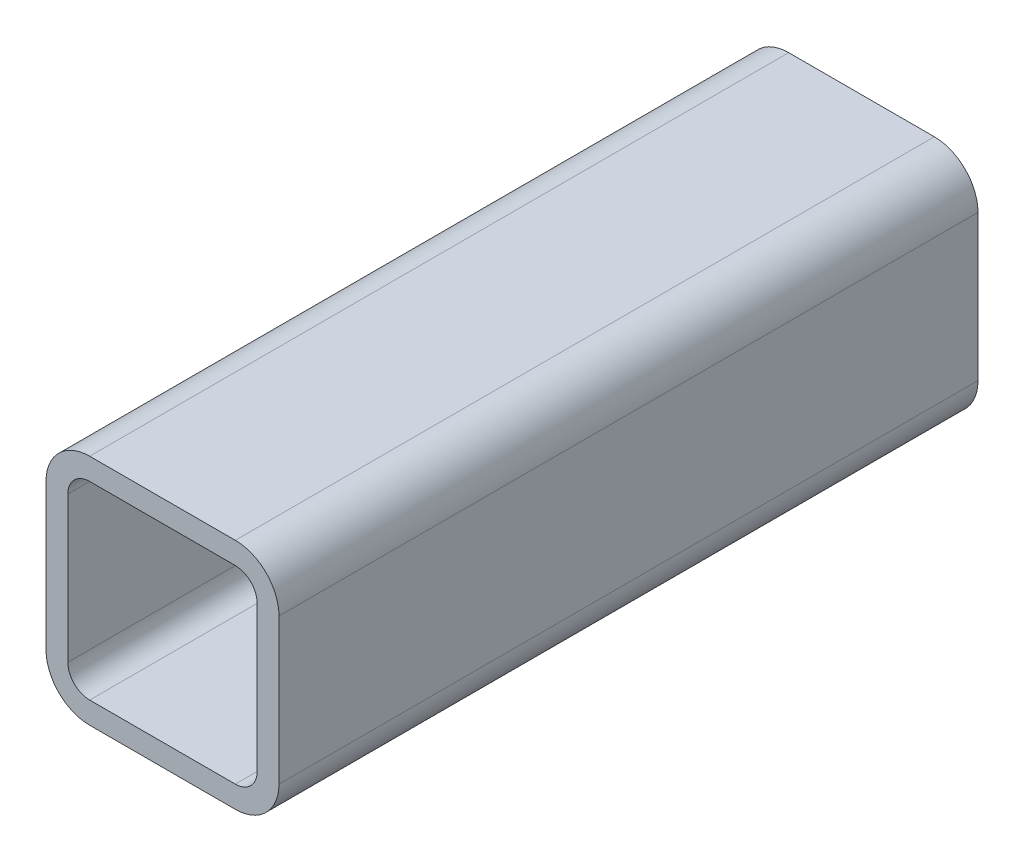
ISO-10303-21;
HEADER;
FILE_DESCRIPTION(('STEP AP214'),'2;1');
FILE_NAME('part.step','',(''),(''),'','','');
FILE_SCHEMA(('AUTOMOTIVE_DESIGN { 1 0 10303 214 1 1 1 1 }'));
ENDSEC;
DATA;
#1=APPLICATION_CONTEXT('core data for automotive mechanical design processes');
#2=APPLICATION_PROTOCOL_DEFINITION('international standard','automotive_design',2000,#1);
#3=PRODUCT_CONTEXT('',#1,'mechanical');
#4=PRODUCT('Part','Part','',(#3));
#5=PRODUCT_RELATED_PRODUCT_CATEGORY('part','',(#4));
#6=PRODUCT_DEFINITION_FORMATION('','',#4);
#7=PRODUCT_DEFINITION_CONTEXT('part definition',#1,'design');
#8=PRODUCT_DEFINITION('design','',#6,#7);
#9=PRODUCT_DEFINITION_SHAPE('','',#8);
#10=(LENGTH_UNIT() NAMED_UNIT(*) SI_UNIT(.MILLI.,.METRE.));
#11=(NAMED_UNIT(*) PLANE_ANGLE_UNIT() SI_UNIT($,.RADIAN.));
#12=(NAMED_UNIT(*) SI_UNIT($,.STERADIAN.) SOLID_ANGLE_UNIT());
#13=UNCERTAINTY_MEASURE_WITH_UNIT(LENGTH_MEASURE(1.E-05),#10,'distance_accuracy_value','');
#14=(GEOMETRIC_REPRESENTATION_CONTEXT(3) GLOBAL_UNCERTAINTY_ASSIGNED_CONTEXT((#13)) GLOBAL_UNIT_ASSIGNED_CONTEXT((#10,
#11,#12)) REPRESENTATION_CONTEXT('',''));
#15=CARTESIAN_POINT('',(0.,0.,0.));
#16=DIRECTION('',(0.,0.,1.));
#17=DIRECTION('',(1.,0.,0.));
#18=AXIS2_PLACEMENT_3D('',#15,#16,#17);
#19=CARTESIAN_POINT('',(41.27496425,41.27496425,76.2));
#20=DIRECTION('',(0.,0.,1.));
#21=DIRECTION('',(1.,0.,0.));
#22=AXIS2_PLACEMENT_3D('',#19,#20,#21);
#23=PLANE('',#22);
#24=CARTESIAN_POINT('',(41.27496425,41.27496425,76.2));
#25=DIRECTION('',(0.,0.,1.));
#26=DIRECTION('',(1.,0.,0.));
#27=AXIS2_PLACEMENT_3D('',#24,#25,#26);
#28=CIRCLE('',#27,9.52499175);
#29=CARTESIAN_POINT('',(50.799956,41.27496425,76.2));
#30=VERTEX_POINT('',#29);
#31=CARTESIAN_POINT('',(41.27496425,50.799956,76.2));
#32=VERTEX_POINT('',#31);
#33=EDGE_CURVE('E213',#30,#32,#28,.T.);
#34=ORIENTED_EDGE('',*,*,#33,.T.);
#35=DIRECTION('',(-1.,0.,0.));
#36=VECTOR('',#35,1.);
#37=CARTESIAN_POINT('',(41.27496425,50.799956,76.2));
#38=LINE('',#37,#36);
#39=CARTESIAN_POINT('',(9.52499174999999,50.799956,76.2));
#40=VERTEX_POINT('',#39);
#41=EDGE_CURVE('E216',#32,#40,#38,.T.);
#42=ORIENTED_EDGE('',*,*,#41,.T.);
#43=CARTESIAN_POINT('',(9.52499174999999,41.27496425,76.2));
#44=DIRECTION('',(0.,0.,1.));
#45=DIRECTION('',(1.,0.,0.));
#46=AXIS2_PLACEMENT_3D('',#43,#44,#45);
#47=CIRCLE('',#46,9.52499175);
#48=CARTESIAN_POINT('',(0.,41.27496425,76.2));
#49=VERTEX_POINT('',#48);
#50=EDGE_CURVE('E219',#40,#49,#47,.T.);
#51=ORIENTED_EDGE('',*,*,#50,.T.);
#52=DIRECTION('',(0.,-1.,0.));
#53=VECTOR('',#52,1.);
#54=CARTESIAN_POINT('',(0.,9.52499175,76.2));
#55=LINE('',#54,#53);
#56=CARTESIAN_POINT('',(0.,9.52499175,76.2));
#57=VERTEX_POINT('',#56);
#58=EDGE_CURVE('E221',#49,#57,#55,.T.);
#59=ORIENTED_EDGE('',*,*,#58,.T.);
#60=CARTESIAN_POINT('',(9.52499175,9.52499175,76.2));
#61=DIRECTION('',(0.,0.,1.));
#62=DIRECTION('',(1.,0.,0.));
#63=AXIS2_PLACEMENT_3D('',#60,#61,#62);
#64=CIRCLE('',#63,9.52499175);
#65=CARTESIAN_POINT('',(9.52499175,0.,76.2));
#66=VERTEX_POINT('',#65);
#67=EDGE_CURVE('E223',#57,#66,#64,.T.);
#68=ORIENTED_EDGE('',*,*,#67,.T.);
#69=DIRECTION('',(1.,0.,0.));
#70=VECTOR('',#69,1.);
#71=CARTESIAN_POINT('',(9.52499175,0.,76.2));
#72=LINE('',#71,#70);
#73=CARTESIAN_POINT('',(41.27496425,0.,76.2));
#74=VERTEX_POINT('',#73);
#75=EDGE_CURVE('E225',#66,#74,#72,.T.);
#76=ORIENTED_EDGE('',*,*,#75,.T.);
#77=CARTESIAN_POINT('',(41.27496425,9.52499175,76.2));
#78=DIRECTION('',(0.,0.,1.));
#79=DIRECTION('',(1.,0.,0.));
#80=AXIS2_PLACEMENT_3D('',#77,#78,#79);
#81=CIRCLE('',#80,9.52499175);
#82=CARTESIAN_POINT('',(50.799956,9.52499175,76.2));
#83=VERTEX_POINT('',#82);
#84=EDGE_CURVE('E227',#74,#83,#81,.T.);
#85=ORIENTED_EDGE('',*,*,#84,.T.);
#86=DIRECTION('',(0.,1.,0.));
#87=VECTOR('',#86,1.);
#88=CARTESIAN_POINT('',(50.799956,41.27496425,76.2));
#89=LINE('',#88,#87);
#90=EDGE_CURVE('E229',#83,#30,#89,.T.);
#91=ORIENTED_EDGE('',*,*,#90,.T.);
#92=EDGE_LOOP('',(#34,#42,#51,#59,#68,#76,#85,#91));
#93=FACE_BOUND('',#92,.T.);
#94=DIRECTION('',(0.,-1.,0.));
#95=VECTOR('',#94,1.);
#96=CARTESIAN_POINT('',(4.762495875,9.52499175,76.2));
#97=LINE('',#96,#95);
#98=CARTESIAN_POINT('',(4.76249587499999,41.27496425,76.2));
#99=VERTEX_POINT('',#98);
#100=CARTESIAN_POINT('',(4.762495875,9.52499175,76.2));
#101=VERTEX_POINT('',#100);
#102=EDGE_CURVE('E156',#99,#101,#97,.T.);
#103=ORIENTED_EDGE('',*,*,#102,.F.);
#104=CARTESIAN_POINT('',(9.52499174999999,41.27496425,76.2));
#105=DIRECTION('',(0.,0.,1.));
#106=DIRECTION('',(1.,0.,0.));
#107=AXIS2_PLACEMENT_3D('',#104,#105,#106);
#108=CIRCLE('',#107,4.762495875);
#109=CARTESIAN_POINT('',(9.52499174999999,46.037460125,76.2));
#110=VERTEX_POINT('',#109);
#111=EDGE_CURVE('E148',#110,#99,#108,.T.);
#112=ORIENTED_EDGE('',*,*,#111,.F.);
#113=DIRECTION('',(-1.,0.,0.));
#114=VECTOR('',#113,1.);
#115=CARTESIAN_POINT('',(41.27496425,46.037460125,76.2));
#116=LINE('',#115,#114);
#117=CARTESIAN_POINT('',(41.27496425,46.037460125,76.2));
#118=VERTEX_POINT('',#117);
#119=EDGE_CURVE('E181',#118,#110,#116,.T.);
#120=ORIENTED_EDGE('',*,*,#119,.F.);
#121=CARTESIAN_POINT('',(41.27496425,41.27496425,76.2));
#122=DIRECTION('',(0.,0.,1.));
#123=DIRECTION('',(1.,0.,0.));
#124=AXIS2_PLACEMENT_3D('',#121,#122,#123);
#125=CIRCLE('',#124,4.76249587500001);
#126=CARTESIAN_POINT('',(46.037460125,41.27496425,76.2));
#127=VERTEX_POINT('',#126);
#128=EDGE_CURVE('E179',#127,#118,#125,.T.);
#129=ORIENTED_EDGE('',*,*,#128,.F.);
#130=DIRECTION('',(0.,1.,0.));
#131=VECTOR('',#130,1.);
#132=CARTESIAN_POINT('',(46.037460125,41.27496425,76.2));
#133=LINE('',#132,#131);
#134=CARTESIAN_POINT('',(46.037460125,9.52499175,76.2));
#135=VERTEX_POINT('',#134);
#136=EDGE_CURVE('E177',#135,#127,#133,.T.);
#137=ORIENTED_EDGE('',*,*,#136,.F.);
#138=CARTESIAN_POINT('',(41.27496425,9.52499175,76.2));
#139=DIRECTION('',(0.,0.,1.));
#140=DIRECTION('',(1.,0.,0.));
#141=AXIS2_PLACEMENT_3D('',#138,#139,#140);
#142=CIRCLE('',#141,4.762495875);
#143=CARTESIAN_POINT('',(41.27496425,4.762495875,76.2));
#144=VERTEX_POINT('',#143);
#145=EDGE_CURVE('E175',#144,#135,#142,.T.);
#146=ORIENTED_EDGE('',*,*,#145,.F.);
#147=DIRECTION('',(1.,0.,0.));
#148=VECTOR('',#147,1.);
#149=CARTESIAN_POINT('',(9.52499175,4.762495875,76.2));
#150=LINE('',#149,#148);
#151=CARTESIAN_POINT('',(9.52499175,4.762495875,76.2));
#152=VERTEX_POINT('',#151);
#153=EDGE_CURVE('E171',#152,#144,#150,.T.);
#154=ORIENTED_EDGE('',*,*,#153,.F.);
#155=CARTESIAN_POINT('',(9.52499175,9.52499175,76.2));
#156=DIRECTION('',(0.,0.,1.));
#157=DIRECTION('',(1.,0.,0.));
#158=AXIS2_PLACEMENT_3D('',#155,#156,#157);
#159=CIRCLE('',#158,4.762495875);
#160=EDGE_CURVE('E169',#101,#152,#159,.T.);
#161=ORIENTED_EDGE('',*,*,#160,.F.);
#162=EDGE_LOOP('',(#103,#112,#120,#129,#137,#146,#154,#161));
#163=FACE_BOUND('',#162,.T.);
#164=ADVANCED_FACE('F35',(#93,#163),#23,.T.);
#165=CARTESIAN_POINT('',(41.27496425,41.27496425,-76.2));
#166=DIRECTION('',(0.,0.,1.));
#167=DIRECTION('',(1.,0.,0.));
#168=AXIS2_PLACEMENT_3D('',#165,#166,#167);
#169=PLANE('',#168);
#170=CARTESIAN_POINT('',(41.27496425,41.27496425,-76.2));
#171=DIRECTION('',(0.,0.,1.));
#172=DIRECTION('',(1.,0.,0.));
#173=AXIS2_PLACEMENT_3D('',#170,#171,#172);
#174=CIRCLE('',#173,9.52499175);
#175=CARTESIAN_POINT('',(50.799956,41.27496425,-76.2));
#176=VERTEX_POINT('',#175);
#177=CARTESIAN_POINT('',(41.27496425,50.799956,-76.2));
#178=VERTEX_POINT('',#177);
#179=EDGE_CURVE('E164',#176,#178,#174,.T.);
#180=ORIENTED_EDGE('',*,*,#179,.F.);
#181=DIRECTION('',(0.,1.,0.));
#182=VECTOR('',#181,1.);
#183=CARTESIAN_POINT('',(50.799956,41.27496425,-76.2));
#184=LINE('',#183,#182);
#185=CARTESIAN_POINT('',(50.799956,9.52499175,-76.2));
#186=VERTEX_POINT('',#185);
#187=EDGE_CURVE('E217',#186,#176,#184,.T.);
#188=ORIENTED_EDGE('',*,*,#187,.F.);
#189=CARTESIAN_POINT('',(41.27496425,9.52499175,-76.2));
#190=DIRECTION('',(0.,0.,1.));
#191=DIRECTION('',(1.,0.,0.));
#192=AXIS2_PLACEMENT_3D('',#189,#190,#191);
#193=CIRCLE('',#192,9.52499175);
#194=CARTESIAN_POINT('',(41.27496425,0.,-76.2));
#195=VERTEX_POINT('',#194);
#196=EDGE_CURVE('E244',#195,#186,#193,.T.);
#197=ORIENTED_EDGE('',*,*,#196,.F.);
#198=DIRECTION('',(1.,0.,0.));
#199=VECTOR('',#198,1.);
#200=CARTESIAN_POINT('',(9.52499175,0.,-76.2));
#201=LINE('',#200,#199);
#202=CARTESIAN_POINT('',(9.52499175,0.,-76.2));
#203=VERTEX_POINT('',#202);
#204=EDGE_CURVE('E242',#203,#195,#201,.T.);
#205=ORIENTED_EDGE('',*,*,#204,.F.);
#206=CARTESIAN_POINT('',(9.52499175,9.52499175,-76.2));
#207=DIRECTION('',(0.,0.,1.));
#208=DIRECTION('',(1.,0.,0.));
#209=AXIS2_PLACEMENT_3D('',#206,#207,#208);
#210=CIRCLE('',#209,9.52499175);
#211=CARTESIAN_POINT('',(0.,9.52499175,-76.2));
#212=VERTEX_POINT('',#211);
#213=EDGE_CURVE('E240',#212,#203,#210,.T.);
#214=ORIENTED_EDGE('',*,*,#213,.F.);
#215=DIRECTION('',(0.,-1.,0.));
#216=VECTOR('',#215,1.);
#217=CARTESIAN_POINT('',(0.,9.52499175,-76.2));
#218=LINE('',#217,#216);
#219=CARTESIAN_POINT('',(0.,41.27496425,-76.2));
#220=VERTEX_POINT('',#219);
#221=EDGE_CURVE('E238',#220,#212,#218,.T.);
#222=ORIENTED_EDGE('',*,*,#221,.F.);
#223=CARTESIAN_POINT('',(9.52499174999999,41.27496425,-76.2));
#224=DIRECTION('',(0.,0.,1.));
#225=DIRECTION('',(1.,0.,0.));
#226=AXIS2_PLACEMENT_3D('',#223,#224,#225);
#227=CIRCLE('',#226,9.52499175);
#228=CARTESIAN_POINT('',(9.52499174999999,50.799956,-76.2));
#229=VERTEX_POINT('',#228);
#230=EDGE_CURVE('E236',#229,#220,#227,.T.);
#231=ORIENTED_EDGE('',*,*,#230,.F.);
#232=DIRECTION('',(-1.,0.,0.));
#233=VECTOR('',#232,1.);
#234=CARTESIAN_POINT('',(41.27496425,50.799956,-76.2));
#235=LINE('',#234,#233);
#236=EDGE_CURVE('E234',#178,#229,#235,.T.);
#237=ORIENTED_EDGE('',*,*,#236,.F.);
#238=EDGE_LOOP('',(#180,#188,#197,#205,#214,#222,#231,#237));
#239=FACE_BOUND('',#238,.T.);
#240=CARTESIAN_POINT('',(9.52499174999999,41.27496425,-76.2));
#241=DIRECTION('',(0.,0.,1.));
#242=DIRECTION('',(1.,0.,0.));
#243=AXIS2_PLACEMENT_3D('',#240,#241,#242);
#244=CIRCLE('',#243,4.762495875);
#245=CARTESIAN_POINT('',(9.52499175,46.037460125,-76.2));
#246=VERTEX_POINT('',#245);
#247=CARTESIAN_POINT('',(4.76249587499999,41.27496425,-76.2));
#248=VERTEX_POINT('',#247);
#249=EDGE_CURVE('E58',#246,#248,#244,.T.);
#250=ORIENTED_EDGE('',*,*,#249,.T.);
#251=DIRECTION('',(0.,-1.,0.));
#252=VECTOR('',#251,1.);
#253=CARTESIAN_POINT('',(4.762495875,9.52499175,-76.2));
#254=LINE('',#253,#252);
#255=CARTESIAN_POINT('',(4.762495875,9.52499175,-76.2));
#256=VERTEX_POINT('',#255);
#257=EDGE_CURVE('E163',#248,#256,#254,.T.);
#258=ORIENTED_EDGE('',*,*,#257,.T.);
#259=CARTESIAN_POINT('',(9.52499175,9.52499175,-76.2));
#260=DIRECTION('',(0.,0.,1.));
#261=DIRECTION('',(1.,0.,0.));
#262=AXIS2_PLACEMENT_3D('',#259,#260,#261);
#263=CIRCLE('',#262,4.762495875);
#264=CARTESIAN_POINT('',(9.52499175,4.762495875,-76.2));
#265=VERTEX_POINT('',#264);
#266=EDGE_CURVE('E185',#256,#265,#263,.T.);
#267=ORIENTED_EDGE('',*,*,#266,.T.);
#268=DIRECTION('',(1.,0.,0.));
#269=VECTOR('',#268,1.);
#270=CARTESIAN_POINT('',(9.52499175,4.762495875,-76.2));
#271=LINE('',#270,#269);
#272=CARTESIAN_POINT('',(41.27496425,4.762495875,-76.2));
#273=VERTEX_POINT('',#272);
#274=EDGE_CURVE('E188',#265,#273,#271,.T.);
#275=ORIENTED_EDGE('',*,*,#274,.T.);
#276=CARTESIAN_POINT('',(41.27496425,9.52499175,-76.2));
#277=DIRECTION('',(0.,0.,1.));
#278=DIRECTION('',(1.,0.,0.));
#279=AXIS2_PLACEMENT_3D('',#276,#277,#278);
#280=CIRCLE('',#279,4.762495875);
#281=CARTESIAN_POINT('',(46.037460125,9.52499175,-76.2));
#282=VERTEX_POINT('',#281);
#283=EDGE_CURVE('E191',#273,#282,#280,.T.);
#284=ORIENTED_EDGE('',*,*,#283,.T.);
#285=DIRECTION('',(0.,1.,0.));
#286=VECTOR('',#285,1.);
#287=CARTESIAN_POINT('',(46.037460125,41.27496425,-76.2));
#288=LINE('',#287,#286);
#289=CARTESIAN_POINT('',(46.037460125,41.27496425,-76.2));
#290=VERTEX_POINT('',#289);
#291=EDGE_CURVE('E194',#282,#290,#288,.T.);
#292=ORIENTED_EDGE('',*,*,#291,.T.);
#293=CARTESIAN_POINT('',(41.27496425,41.27496425,-76.2));
#294=DIRECTION('',(0.,0.,1.));
#295=DIRECTION('',(1.,0.,0.));
#296=AXIS2_PLACEMENT_3D('',#293,#294,#295);
#297=CIRCLE('',#296,4.76249587500001);
#298=CARTESIAN_POINT('',(41.27496425,46.037460125,-76.2));
#299=VERTEX_POINT('',#298);
#300=EDGE_CURVE('E197',#290,#299,#297,.T.);
#301=ORIENTED_EDGE('',*,*,#300,.T.);
#302=DIRECTION('',(-1.,0.,0.));
#303=VECTOR('',#302,1.);
#304=CARTESIAN_POINT('',(41.27496425,46.037460125,-76.2));
#305=LINE('',#304,#303);
#306=EDGE_CURVE('E157',#299,#246,#305,.T.);
#307=ORIENTED_EDGE('',*,*,#306,.T.);
#308=EDGE_LOOP('',(#250,#258,#267,#275,#284,#292,#301,#307));
#309=FACE_BOUND('',#308,.T.);
#310=ADVANCED_FACE('F274',(#239,#309),#169,.F.);
#311=CARTESIAN_POINT('',(41.27496425,41.27496425,76.2));
#312=DIRECTION('',(0.,0.,-1.));
#313=DIRECTION('',(-1.,0.,0.));
#314=AXIS2_PLACEMENT_3D('',#311,#312,#313);
#315=CYLINDRICAL_SURFACE('',#314,9.52499175);
#316=ORIENTED_EDGE('',*,*,#179,.T.);
#317=DIRECTION('',(0.,0.,-1.));
#318=VECTOR('',#317,1.);
#319=CARTESIAN_POINT('',(41.27496425,50.799956,76.2));
#320=LINE('',#319,#318);
#321=EDGE_CURVE('E11',#32,#178,#320,.T.);
#322=ORIENTED_EDGE('',*,*,#321,.F.);
#323=ORIENTED_EDGE('',*,*,#33,.F.);
#324=DIRECTION('',(0.,0.,-1.));
#325=VECTOR('',#324,1.);
#326=CARTESIAN_POINT('',(50.799956,41.27496425,76.2));
#327=LINE('',#326,#325);
#328=EDGE_CURVE('E231',#30,#176,#327,.T.);
#329=ORIENTED_EDGE('',*,*,#328,.T.);
#330=EDGE_LOOP('',(#316,#322,#323,#329));
#331=FACE_BOUND('',#330,.T.);
#332=ADVANCED_FACE('F37',(#331),#315,.T.);
#333=CARTESIAN_POINT('',(41.27496425,50.799956,76.2));
#334=DIRECTION('',(0.,-1.,0.));
#335=DIRECTION('',(0.,0.,-1.));
#336=AXIS2_PLACEMENT_3D('',#333,#334,#335);
#337=PLANE('',#336);
#338=ORIENTED_EDGE('',*,*,#236,.T.);
#339=DIRECTION('',(0.,0.,-1.));
#340=VECTOR('',#339,1.);
#341=CARTESIAN_POINT('',(9.52499174999999,50.799956,76.2));
#342=LINE('',#341,#340);
#343=EDGE_CURVE('E43',#40,#229,#342,.T.);
#344=ORIENTED_EDGE('',*,*,#343,.F.);
#345=ORIENTED_EDGE('',*,*,#41,.F.);
#346=ORIENTED_EDGE('',*,*,#321,.T.);
#347=EDGE_LOOP('',(#338,#344,#345,#346));
#348=FACE_BOUND('',#347,.T.);
#349=ADVANCED_FACE('F291',(#348),#337,.F.);
#350=CARTESIAN_POINT('',(9.52499174999999,41.27496425,76.2));
#351=DIRECTION('',(0.,0.,-1.));
#352=DIRECTION('',(-1.,0.,0.));
#353=AXIS2_PLACEMENT_3D('',#350,#351,#352);
#354=CYLINDRICAL_SURFACE('',#353,9.52499175);
#355=ORIENTED_EDGE('',*,*,#230,.T.);
#356=DIRECTION('',(0.,0.,-1.));
#357=VECTOR('',#356,1.);
#358=CARTESIAN_POINT('',(0.,41.27496425,76.2));
#359=LINE('',#358,#357);
#360=EDGE_CURVE('E261',#49,#220,#359,.T.);
#361=ORIENTED_EDGE('',*,*,#360,.F.);
#362=ORIENTED_EDGE('',*,*,#50,.F.);
#363=ORIENTED_EDGE('',*,*,#343,.T.);
#364=EDGE_LOOP('',(#355,#361,#362,#363));
#365=FACE_BOUND('',#364,.T.);
#366=ADVANCED_FACE('F268',(#365),#354,.T.);
#367=CARTESIAN_POINT('',(0.,9.52499175,76.2));
#368=DIRECTION('',(1.,0.,0.));
#369=DIRECTION('',(0.,1.,0.));
#370=AXIS2_PLACEMENT_3D('',#367,#368,#369);
#371=PLANE('',#370);
#372=ORIENTED_EDGE('',*,*,#221,.T.);
#373=DIRECTION('',(0.,0.,-1.));
#374=VECTOR('',#373,1.);
#375=CARTESIAN_POINT('',(0.,9.52499175,76.2));
#376=LINE('',#375,#374);
#377=EDGE_CURVE('E258',#57,#212,#376,.T.);
#378=ORIENTED_EDGE('',*,*,#377,.F.);
#379=ORIENTED_EDGE('',*,*,#58,.F.);
#380=ORIENTED_EDGE('',*,*,#360,.T.);
#381=EDGE_LOOP('',(#372,#378,#379,#380));
#382=FACE_BOUND('',#381,.T.);
#383=ADVANCED_FACE('F280',(#382),#371,.F.);
#384=CARTESIAN_POINT('',(9.52499175,9.52499175,76.2));
#385=DIRECTION('',(0.,0.,-1.));
#386=DIRECTION('',(-1.,0.,0.));
#387=AXIS2_PLACEMENT_3D('',#384,#385,#386);
#388=CYLINDRICAL_SURFACE('',#387,9.52499175);
#389=ORIENTED_EDGE('',*,*,#213,.T.);
#390=DIRECTION('',(0.,0.,-1.));
#391=VECTOR('',#390,1.);
#392=CARTESIAN_POINT('',(9.52499175,0.,76.2));
#393=LINE('',#392,#391);
#394=EDGE_CURVE('E255',#66,#203,#393,.T.);
#395=ORIENTED_EDGE('',*,*,#394,.F.);
#396=ORIENTED_EDGE('',*,*,#67,.F.);
#397=ORIENTED_EDGE('',*,*,#377,.T.);
#398=EDGE_LOOP('',(#389,#395,#396,#397));
#399=FACE_BOUND('',#398,.T.);
#400=ADVANCED_FACE('F284',(#399),#388,.T.);
#401=CARTESIAN_POINT('',(9.52499175,0.,76.2));
#402=DIRECTION('',(0.,1.,0.));
#403=DIRECTION('',(0.,0.,1.));
#404=AXIS2_PLACEMENT_3D('',#401,#402,#403);
#405=PLANE('',#404);
#406=ORIENTED_EDGE('',*,*,#204,.T.);
#407=DIRECTION('',(0.,0.,-1.));
#408=VECTOR('',#407,1.);
#409=CARTESIAN_POINT('',(41.27496425,0.,76.2));
#410=LINE('',#409,#408);
#411=EDGE_CURVE('E252',#74,#195,#410,.T.);
#412=ORIENTED_EDGE('',*,*,#411,.F.);
#413=ORIENTED_EDGE('',*,*,#75,.F.);
#414=ORIENTED_EDGE('',*,*,#394,.T.);
#415=EDGE_LOOP('',(#406,#412,#413,#414));
#416=FACE_BOUND('',#415,.T.);
#417=ADVANCED_FACE('F304',(#416),#405,.F.);
#418=CARTESIAN_POINT('',(41.27496425,9.52499175,76.2));
#419=DIRECTION('',(0.,0.,-1.));
#420=DIRECTION('',(-1.,0.,0.));
#421=AXIS2_PLACEMENT_3D('',#418,#419,#420);
#422=CYLINDRICAL_SURFACE('',#421,9.52499175);
#423=ORIENTED_EDGE('',*,*,#196,.T.);
#424=DIRECTION('',(0.,0.,-1.));
#425=VECTOR('',#424,1.);
#426=CARTESIAN_POINT('',(50.799956,9.52499175,76.2));
#427=LINE('',#426,#425);
#428=EDGE_CURVE('E249',#83,#186,#427,.T.);
#429=ORIENTED_EDGE('',*,*,#428,.F.);
#430=ORIENTED_EDGE('',*,*,#84,.F.);
#431=ORIENTED_EDGE('',*,*,#411,.T.);
#432=EDGE_LOOP('',(#423,#429,#430,#431));
#433=FACE_BOUND('',#432,.T.);
#434=ADVANCED_FACE('F302',(#433),#422,.T.);
#435=CARTESIAN_POINT('',(50.799956,41.27496425,76.2));
#436=DIRECTION('',(-1.,0.,0.));
#437=DIRECTION('',(0.,-1.,0.));
#438=AXIS2_PLACEMENT_3D('',#435,#436,#437);
#439=PLANE('',#438);
#440=ORIENTED_EDGE('',*,*,#187,.T.);
#441=ORIENTED_EDGE('',*,*,#328,.F.);
#442=ORIENTED_EDGE('',*,*,#90,.F.);
#443=ORIENTED_EDGE('',*,*,#428,.T.);
#444=EDGE_LOOP('',(#440,#441,#442,#443));
#445=FACE_BOUND('',#444,.T.);
#446=ADVANCED_FACE('F297',(#445),#439,.F.);
#447=CARTESIAN_POINT('',(9.52499174999999,41.27496425,76.2));
#448=DIRECTION('',(0.,0.,-1.));
#449=DIRECTION('',(-1.,0.,0.));
#450=AXIS2_PLACEMENT_3D('',#447,#448,#449);
#451=CYLINDRICAL_SURFACE('',#450,4.762495875);
#452=ORIENTED_EDGE('',*,*,#249,.F.);
#453=DIRECTION('',(0.,0.,-1.));
#454=VECTOR('',#453,1.);
#455=CARTESIAN_POINT('',(9.52499174999999,46.037460125,76.2));
#456=LINE('',#455,#454);
#457=EDGE_CURVE('E152',#110,#246,#456,.T.);
#458=ORIENTED_EDGE('',*,*,#457,.F.);
#459=ORIENTED_EDGE('',*,*,#111,.T.);
#460=DIRECTION('',(0.,0.,-1.));
#461=VECTOR('',#460,1.);
#462=CARTESIAN_POINT('',(4.76249587499999,41.27496425,76.2));
#463=LINE('',#462,#461);
#464=EDGE_CURVE('E151',#99,#248,#463,.T.);
#465=ORIENTED_EDGE('',*,*,#464,.T.);
#466=EDGE_LOOP('',(#452,#458,#459,#465));
#467=FACE_BOUND('',#466,.T.);
#468=ADVANCED_FACE('F150',(#467),#451,.F.);
#469=CARTESIAN_POINT('',(4.762495875,9.52499175,76.2));
#470=DIRECTION('',(1.,0.,0.));
#471=DIRECTION('',(0.,1.,0.));
#472=AXIS2_PLACEMENT_3D('',#469,#470,#471);
#473=PLANE('',#472);
#474=ORIENTED_EDGE('',*,*,#257,.F.);
#475=ORIENTED_EDGE('',*,*,#464,.F.);
#476=ORIENTED_EDGE('',*,*,#102,.T.);
#477=DIRECTION('',(0.,0.,-1.));
#478=VECTOR('',#477,1.);
#479=CARTESIAN_POINT('',(4.762495875,9.52499175,76.2));
#480=LINE('',#479,#478);
#481=EDGE_CURVE('E165',#101,#256,#480,.T.);
#482=ORIENTED_EDGE('',*,*,#481,.T.);
#483=EDGE_LOOP('',(#474,#475,#476,#482));
#484=FACE_BOUND('',#483,.T.);
#485=ADVANCED_FACE('F160',(#484),#473,.T.);
#486=CARTESIAN_POINT('',(9.52499175,9.52499175,76.2));
#487=DIRECTION('',(0.,0.,-1.));
#488=DIRECTION('',(-1.,0.,0.));
#489=AXIS2_PLACEMENT_3D('',#486,#487,#488);
#490=CYLINDRICAL_SURFACE('',#489,4.762495875);
#491=ORIENTED_EDGE('',*,*,#266,.F.);
#492=ORIENTED_EDGE('',*,*,#481,.F.);
#493=ORIENTED_EDGE('',*,*,#160,.T.);
#494=DIRECTION('',(0.,0.,-1.));
#495=VECTOR('',#494,1.);
#496=CARTESIAN_POINT('',(9.52499175,4.762495875,76.2));
#497=LINE('',#496,#495);
#498=EDGE_CURVE('E210',#152,#265,#497,.T.);
#499=ORIENTED_EDGE('',*,*,#498,.T.);
#500=EDGE_LOOP('',(#491,#492,#493,#499));
#501=FACE_BOUND('',#500,.T.);
#502=ADVANCED_FACE('F329',(#501),#490,.F.);
#503=CARTESIAN_POINT('',(9.52499175,4.762495875,76.2));
#504=DIRECTION('',(0.,1.,0.));
#505=DIRECTION('',(0.,0.,1.));
#506=AXIS2_PLACEMENT_3D('',#503,#504,#505);
#507=PLANE('',#506);
#508=ORIENTED_EDGE('',*,*,#274,.F.);
#509=ORIENTED_EDGE('',*,*,#498,.F.);
#510=ORIENTED_EDGE('',*,*,#153,.T.);
#511=DIRECTION('',(0.,0.,-1.));
#512=VECTOR('',#511,1.);
#513=CARTESIAN_POINT('',(41.27496425,4.762495875,76.2));
#514=LINE('',#513,#512);
#515=EDGE_CURVE('E208',#144,#273,#514,.T.);
#516=ORIENTED_EDGE('',*,*,#515,.T.);
#517=EDGE_LOOP('',(#508,#509,#510,#516));
#518=FACE_BOUND('',#517,.T.);
#519=ADVANCED_FACE('F333',(#518),#507,.T.);
#520=CARTESIAN_POINT('',(41.27496425,9.52499175,76.2));
#521=DIRECTION('',(0.,0.,-1.));
#522=DIRECTION('',(-1.,0.,0.));
#523=AXIS2_PLACEMENT_3D('',#520,#521,#522);
#524=CYLINDRICAL_SURFACE('',#523,4.762495875);
#525=ORIENTED_EDGE('',*,*,#283,.F.);
#526=ORIENTED_EDGE('',*,*,#515,.F.);
#527=ORIENTED_EDGE('',*,*,#145,.T.);
#528=DIRECTION('',(0.,0.,-1.));
#529=VECTOR('',#528,1.);
#530=CARTESIAN_POINT('',(46.037460125,9.52499175,76.2));
#531=LINE('',#530,#529);
#532=EDGE_CURVE('E206',#135,#282,#531,.T.);
#533=ORIENTED_EDGE('',*,*,#532,.T.);
#534=EDGE_LOOP('',(#525,#526,#527,#533));
#535=FACE_BOUND('',#534,.T.);
#536=ADVANCED_FACE('F339',(#535),#524,.F.);
#537=CARTESIAN_POINT('',(46.037460125,41.27496425,76.2));
#538=DIRECTION('',(-1.,0.,0.));
#539=DIRECTION('',(0.,-1.,0.));
#540=AXIS2_PLACEMENT_3D('',#537,#538,#539);
#541=PLANE('',#540);
#542=ORIENTED_EDGE('',*,*,#291,.F.);
#543=ORIENTED_EDGE('',*,*,#532,.F.);
#544=ORIENTED_EDGE('',*,*,#136,.T.);
#545=DIRECTION('',(0.,0.,-1.));
#546=VECTOR('',#545,1.);
#547=CARTESIAN_POINT('',(46.037460125,41.27496425,76.2));
#548=LINE('',#547,#546);
#549=EDGE_CURVE('E204',#127,#290,#548,.T.);
#550=ORIENTED_EDGE('',*,*,#549,.T.);
#551=EDGE_LOOP('',(#542,#543,#544,#550));
#552=FACE_BOUND('',#551,.T.);
#553=ADVANCED_FACE('F343',(#552),#541,.T.);
#554=CARTESIAN_POINT('',(41.27496425,41.27496425,76.2));
#555=DIRECTION('',(0.,0.,-1.));
#556=DIRECTION('',(-1.,0.,0.));
#557=AXIS2_PLACEMENT_3D('',#554,#555,#556);
#558=CYLINDRICAL_SURFACE('',#557,4.76249587500001);
#559=ORIENTED_EDGE('',*,*,#300,.F.);
#560=ORIENTED_EDGE('',*,*,#549,.F.);
#561=ORIENTED_EDGE('',*,*,#128,.T.);
#562=DIRECTION('',(0.,0.,-1.));
#563=VECTOR('',#562,1.);
#564=CARTESIAN_POINT('',(41.27496425,46.037460125,76.2));
#565=LINE('',#564,#563);
#566=EDGE_CURVE('E50',#118,#299,#565,.T.);
#567=ORIENTED_EDGE('',*,*,#566,.T.);
#568=EDGE_LOOP('',(#559,#560,#561,#567));
#569=FACE_BOUND('',#568,.T.);
#570=ADVANCED_FACE('F347',(#569),#558,.F.);
#571=CARTESIAN_POINT('',(41.27496425,46.037460125,76.2));
#572=DIRECTION('',(0.,-1.,0.));
#573=DIRECTION('',(1.,0.,0.));
#574=AXIS2_PLACEMENT_3D('',#571,#572,#573);
#575=PLANE('',#574);
#576=ORIENTED_EDGE('',*,*,#306,.F.);
#577=ORIENTED_EDGE('',*,*,#566,.F.);
#578=ORIENTED_EDGE('',*,*,#119,.T.);
#579=ORIENTED_EDGE('',*,*,#457,.T.);
#580=EDGE_LOOP('',(#576,#577,#578,#579));
#581=FACE_BOUND('',#580,.T.);
#582=ADVANCED_FACE('F351',(#581),#575,.T.);
#583=CLOSED_SHELL('',(#164,#310,#332,#349,#366,#383,#400,#417,#434,#446,#468,#485,#502,#519,
#536,#553,#570,#582));
#584=MANIFOLD_SOLID_BREP('B2',#583);
#585=ADVANCED_BREP_SHAPE_REPRESENTATION('',(#18,#584),#14);
#586=SHAPE_DEFINITION_REPRESENTATION(#9,#585);
ENDSEC;
END-ISO-10303-21;
